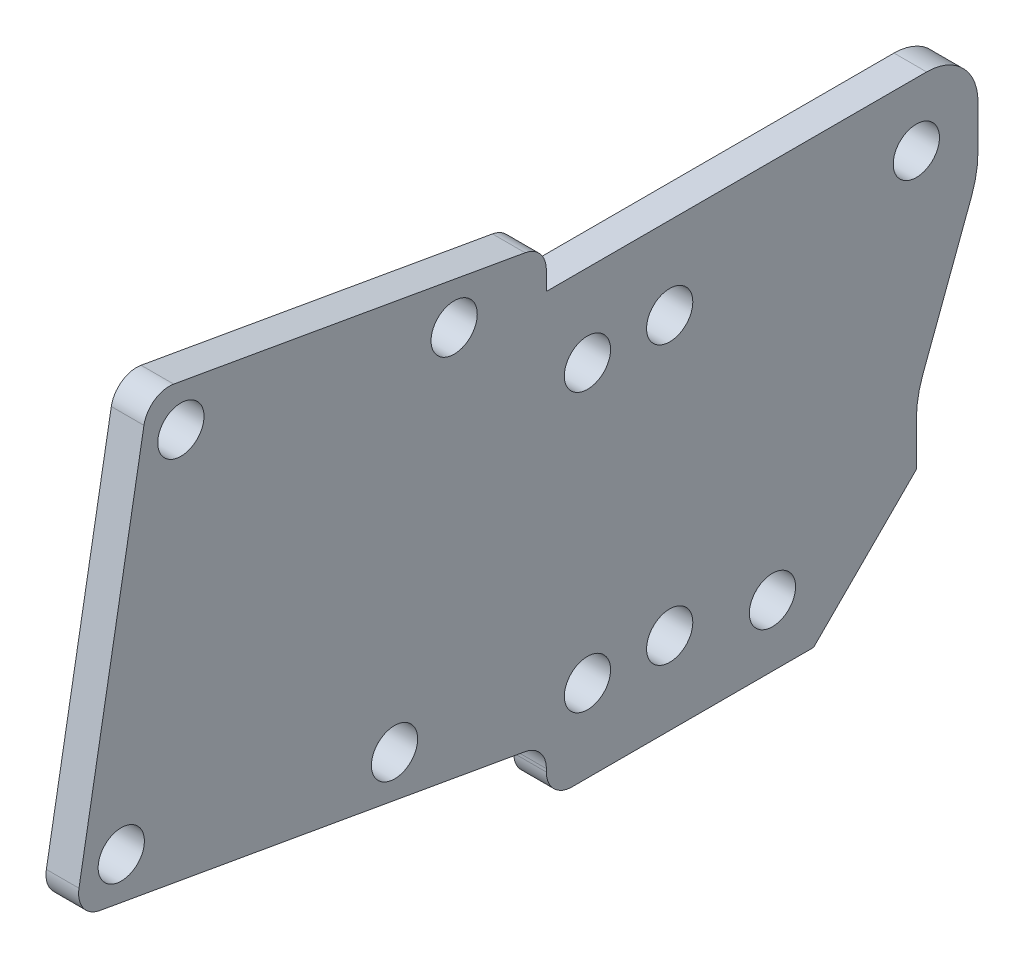
ISO-10303-21;
HEADER;
FILE_DESCRIPTION(('STEP AP214'),'2;1');
FILE_NAME('part.step','',(''),(''),'','','');
FILE_SCHEMA(('AUTOMOTIVE_DESIGN { 1 0 10303 214 1 1 1 1 }'));
ENDSEC;
DATA;
#1=APPLICATION_CONTEXT('core data for automotive mechanical design processes');
#2=APPLICATION_PROTOCOL_DEFINITION('international standard','automotive_design',2000,#1);
#3=PRODUCT_CONTEXT('',#1,'mechanical');
#4=PRODUCT('Part','Part','',(#3));
#5=PRODUCT_RELATED_PRODUCT_CATEGORY('part','',(#4));
#6=PRODUCT_DEFINITION_FORMATION('','',#4);
#7=PRODUCT_DEFINITION_CONTEXT('part definition',#1,'design');
#8=PRODUCT_DEFINITION('design','',#6,#7);
#9=PRODUCT_DEFINITION_SHAPE('','',#8);
#10=(LENGTH_UNIT() NAMED_UNIT(*) SI_UNIT(.MILLI.,.METRE.));
#11=(NAMED_UNIT(*) PLANE_ANGLE_UNIT() SI_UNIT($,.RADIAN.));
#12=(NAMED_UNIT(*) SI_UNIT($,.STERADIAN.) SOLID_ANGLE_UNIT());
#13=UNCERTAINTY_MEASURE_WITH_UNIT(LENGTH_MEASURE(1.E-05),#10,'distance_accuracy_value','');
#14=(GEOMETRIC_REPRESENTATION_CONTEXT(3) GLOBAL_UNCERTAINTY_ASSIGNED_CONTEXT((#13)) GLOBAL_UNIT_ASSIGNED_CONTEXT((#10,
#11,#12)) REPRESENTATION_CONTEXT('',''));
#15=CARTESIAN_POINT('',(0.,0.,0.));
#16=DIRECTION('',(0.,0.,1.));
#17=DIRECTION('',(1.,0.,0.));
#18=AXIS2_PLACEMENT_3D('',#15,#16,#17);
#19=CARTESIAN_POINT('',(-17.375,204.756416597147,-36.1040807192578));
#20=DIRECTION('',(0.,0.98480775301221,-0.173648177666922));
#21=DIRECTION('',(0.,0.173648177666922,0.98480775301221));
#22=AXIS2_PLACEMENT_3D('',#19,#20,#21);
#23=PLANE('',#22);
#24=DIRECTION('',(0.,0.173648177666922,0.98480775301221));
#25=VECTOR('',#24,1.);
#26=CARTESIAN_POINT('',(-14.2,204.756416597147,-36.1040807192578));
#27=LINE('',#26,#25);
#28=CARTESIAN_POINT('',(-14.2,221.819571515731,60.6658795558327));
#29=VERTEX_POINT('',#28);
#30=CARTESIAN_POINT('',(-14.2,227.84859479087,94.8581696461836));
#31=VERTEX_POINT('',#30);
#32=EDGE_CURVE('E236',#29,#31,#27,.T.);
#33=ORIENTED_EDGE('',*,*,#32,.F.);
#34=DIRECTION('',(1.,0.,0.));
#35=VECTOR('',#34,1.);
#36=CARTESIAN_POINT('',(-17.375,221.819571515731,60.6658795558327));
#37=LINE('',#36,#35);
#38=CARTESIAN_POINT('',(-17.375,221.819571515731,60.6658795558327));
#39=VERTEX_POINT('',#38);
#40=EDGE_CURVE('E11',#39,#29,#37,.T.);
#41=ORIENTED_EDGE('',*,*,#40,.F.);
#42=DIRECTION('',(0.,0.173648177666922,0.98480775301221));
#43=VECTOR('',#42,1.);
#44=CARTESIAN_POINT('',(-17.375,204.756416597147,-36.1040807192578));
#45=LINE('',#44,#43);
#46=CARTESIAN_POINT('',(-17.375,227.84859479087,94.8581696461836));
#47=VERTEX_POINT('',#46);
#48=EDGE_CURVE('E326',#39,#47,#45,.T.);
#49=ORIENTED_EDGE('',*,*,#48,.T.);
#50=DIRECTION('',(1.,0.,0.));
#51=VECTOR('',#50,1.);
#52=CARTESIAN_POINT('',(-17.375,227.84859479087,94.8581696461836));
#53=LINE('',#52,#51);
#54=EDGE_CURVE('E45',#47,#31,#53,.T.);
#55=ORIENTED_EDGE('',*,*,#54,.T.);
#56=EDGE_LOOP('',(#33,#41,#49,#55));
#57=FACE_BOUND('',#56,.T.);
#58=ADVANCED_FACE('F41',(#57),#23,.T.);
#59=CARTESIAN_POINT('',(-17.375,219.357552133201,61.1));
#60=DIRECTION('',(1.,0.,0.));
#61=DIRECTION('',(0.,0.,-1.));
#62=AXIS2_PLACEMENT_3D('',#59,#60,#61);
#63=CYLINDRICAL_SURFACE('',#62,2.50000000000001);
#64=CARTESIAN_POINT('',(-14.2,219.357552133201,61.1));
#65=DIRECTION('',(1.,0.,0.));
#66=DIRECTION('',(0.,0.,-1.));
#67=AXIS2_PLACEMENT_3D('',#64,#65,#66);
#68=CIRCLE('',#67,2.50000000000001);
#69=CARTESIAN_POINT('',(-14.2,219.357552133201,58.6));
#70=VERTEX_POINT('',#69);
#71=EDGE_CURVE('E287',#70,#29,#68,.T.);
#72=ORIENTED_EDGE('',*,*,#71,.F.);
#73=DIRECTION('',(1.,0.,0.));
#74=VECTOR('',#73,1.);
#75=CARTESIAN_POINT('',(-17.375,219.357552133201,58.6));
#76=LINE('',#75,#74);
#77=CARTESIAN_POINT('',(-17.375,219.357552133201,58.6));
#78=VERTEX_POINT('',#77);
#79=EDGE_CURVE('E51',#78,#70,#76,.T.);
#80=ORIENTED_EDGE('',*,*,#79,.F.);
#81=CARTESIAN_POINT('',(-17.375,219.357552133201,61.1));
#82=DIRECTION('',(1.,0.,0.));
#83=DIRECTION('',(0.,0.,-1.));
#84=AXIS2_PLACEMENT_3D('',#81,#82,#83);
#85=CIRCLE('',#84,2.50000000000001);
#86=EDGE_CURVE('E196',#78,#39,#85,.T.);
#87=ORIENTED_EDGE('',*,*,#86,.T.);
#88=ORIENTED_EDGE('',*,*,#40,.T.);
#89=EDGE_LOOP('',(#72,#80,#87,#88));
#90=FACE_BOUND('',#89,.T.);
#91=ADVANCED_FACE('F331',(#90),#63,.T.);
#92=CARTESIAN_POINT('',(-17.375,-2.21886829521607E-13,58.5999999999992));
#93=DIRECTION('',(0.,0.,-1.));
#94=DIRECTION('',(0.,1.,0.));
#95=AXIS2_PLACEMENT_3D('',#92,#93,#94);
#96=PLANE('',#95);
#97=DIRECTION('',(0.,1.,0.));
#98=VECTOR('',#97,1.);
#99=CARTESIAN_POINT('',(-14.2,-2.21886829521607E-13,58.5999999999992));
#100=LINE('',#99,#98);
#101=CARTESIAN_POINT('',(-14.2,217.525,58.6));
#102=VERTEX_POINT('',#101);
#103=EDGE_CURVE('E182',#102,#70,#100,.T.);
#104=ORIENTED_EDGE('',*,*,#103,.F.);
#105=DIRECTION('',(1.,0.,0.));
#106=VECTOR('',#105,1.);
#107=CARTESIAN_POINT('',(-17.375,217.525,58.6));
#108=LINE('',#107,#106);
#109=CARTESIAN_POINT('',(-17.375,217.525,58.6));
#110=VERTEX_POINT('',#109);
#111=EDGE_CURVE('E177',#110,#102,#108,.T.);
#112=ORIENTED_EDGE('',*,*,#111,.F.);
#113=DIRECTION('',(0.,1.,0.));
#114=VECTOR('',#113,1.);
#115=CARTESIAN_POINT('',(-17.375,-2.21886829521607E-13,58.5999999999992));
#116=LINE('',#115,#114);
#117=EDGE_CURVE('E180',#110,#78,#116,.T.);
#118=ORIENTED_EDGE('',*,*,#117,.T.);
#119=ORIENTED_EDGE('',*,*,#79,.T.);
#120=EDGE_LOOP('',(#104,#112,#118,#119));
#121=FACE_BOUND('',#120,.T.);
#122=ADVANCED_FACE('F179',(#121),#96,.T.);
#123=CARTESIAN_POINT('',(-17.375,217.525,-1.63176529345667E-13));
#124=DIRECTION('',(0.,1.,0.));
#125=DIRECTION('',(0.,0.,1.));
#126=AXIS2_PLACEMENT_3D('',#123,#124,#125);
#127=PLANE('',#126);
#128=DIRECTION('',(0.,0.,1.));
#129=VECTOR('',#128,1.);
#130=CARTESIAN_POINT('',(-14.2,217.525,-1.63176529345667E-13));
#131=LINE('',#130,#129);
#132=CARTESIAN_POINT('',(-14.2,217.525,21.6));
#133=VERTEX_POINT('',#132);
#134=EDGE_CURVE('E284',#133,#102,#131,.T.);
#135=ORIENTED_EDGE('',*,*,#134,.F.);
#136=DIRECTION('',(1.,0.,0.));
#137=VECTOR('',#136,1.);
#138=CARTESIAN_POINT('',(-17.375,217.525,21.6));
#139=LINE('',#138,#137);
#140=CARTESIAN_POINT('',(-17.375,217.525,21.6));
#141=VERTEX_POINT('',#140);
#142=EDGE_CURVE('E187',#141,#133,#139,.T.);
#143=ORIENTED_EDGE('',*,*,#142,.F.);
#144=DIRECTION('',(0.,0.,1.));
#145=VECTOR('',#144,1.);
#146=CARTESIAN_POINT('',(-17.375,217.525,-1.63176529345667E-13));
#147=LINE('',#146,#145);
#148=EDGE_CURVE('E194',#141,#110,#147,.T.);
#149=ORIENTED_EDGE('',*,*,#148,.T.);
#150=ORIENTED_EDGE('',*,*,#111,.T.);
#151=EDGE_LOOP('',(#135,#143,#149,#150));
#152=FACE_BOUND('',#151,.T.);
#153=ADVANCED_FACE('F198',(#152),#127,.T.);
#154=CARTESIAN_POINT('',(-17.375,212.525,21.6));
#155=DIRECTION('',(1.,0.,0.));
#156=DIRECTION('',(0.,0.,-1.));
#157=AXIS2_PLACEMENT_3D('',#154,#155,#156);
#158=CYLINDRICAL_SURFACE('',#157,5.);
#159=CARTESIAN_POINT('',(-14.2,212.525,21.6));
#160=DIRECTION('',(1.,0.,0.));
#161=DIRECTION('',(0.,0.,-1.));
#162=AXIS2_PLACEMENT_3D('',#159,#160,#161);
#163=CIRCLE('',#162,5.);
#164=CARTESIAN_POINT('',(-14.2,212.525,16.6));
#165=VERTEX_POINT('',#164);
#166=EDGE_CURVE('E281',#165,#133,#163,.T.);
#167=ORIENTED_EDGE('',*,*,#166,.F.);
#168=DIRECTION('',(1.,0.,0.));
#169=VECTOR('',#168,1.);
#170=CARTESIAN_POINT('',(-17.375,212.525,16.6));
#171=LINE('',#170,#169);
#172=CARTESIAN_POINT('',(-17.375,212.525,16.6));
#173=VERTEX_POINT('',#172);
#174=EDGE_CURVE('E299',#173,#165,#171,.T.);
#175=ORIENTED_EDGE('',*,*,#174,.F.);
#176=CARTESIAN_POINT('',(-17.375,212.525,21.6));
#177=DIRECTION('',(1.,0.,0.));
#178=DIRECTION('',(0.,0.,-1.));
#179=AXIS2_PLACEMENT_3D('',#176,#177,#178);
#180=CIRCLE('',#179,5.);
#181=EDGE_CURVE('E199',#173,#141,#180,.T.);
#182=ORIENTED_EDGE('',*,*,#181,.T.);
#183=ORIENTED_EDGE('',*,*,#142,.T.);
#184=EDGE_LOOP('',(#167,#175,#182,#183));
#185=FACE_BOUND('',#184,.T.);
#186=ADVANCED_FACE('F346',(#185),#158,.T.);
#187=CARTESIAN_POINT('',(-17.375,0.,16.6));
#188=DIRECTION('',(0.,0.,-1.));
#189=DIRECTION('',(-1.,0.,0.));
#190=AXIS2_PLACEMENT_3D('',#187,#188,#189);
#191=PLANE('',#190);
#192=DIRECTION('',(0.,1.,0.));
#193=VECTOR('',#192,1.);
#194=CARTESIAN_POINT('',(-14.2,0.,16.6));
#195=LINE('',#194,#193);
#196=CARTESIAN_POINT('',(-14.2,208.338345817725,16.6));
#197=VERTEX_POINT('',#196);
#198=EDGE_CURVE('E278',#197,#165,#195,.T.);
#199=ORIENTED_EDGE('',*,*,#198,.F.);
#200=DIRECTION('',(1.,0.,0.));
#201=VECTOR('',#200,1.);
#202=CARTESIAN_POINT('',(-17.375,208.338345817725,16.6));
#203=LINE('',#202,#201);
#204=CARTESIAN_POINT('',(-17.375,208.338345817725,16.6));
#205=VERTEX_POINT('',#204);
#206=EDGE_CURVE('E301',#205,#197,#203,.T.);
#207=ORIENTED_EDGE('',*,*,#206,.F.);
#208=DIRECTION('',(0.,1.,0.));
#209=VECTOR('',#208,1.);
#210=CARTESIAN_POINT('',(-17.375,0.,16.6));
#211=LINE('',#210,#209);
#212=EDGE_CURVE('E201',#205,#173,#211,.T.);
#213=ORIENTED_EDGE('',*,*,#212,.T.);
#214=ORIENTED_EDGE('',*,*,#174,.T.);
#215=EDGE_LOOP('',(#199,#207,#213,#214));
#216=FACE_BOUND('',#215,.T.);
#217=ADVANCED_FACE('F349',(#216),#191,.T.);
#218=CARTESIAN_POINT('',(-17.375,208.338345817725,26.6));
#219=DIRECTION('',(1.,0.,0.));
#220=DIRECTION('',(0.,0.,-1.));
#221=AXIS2_PLACEMENT_3D('',#218,#219,#220);
#222=CYLINDRICAL_SURFACE('',#221,10.);
#223=CARTESIAN_POINT('',(-14.2,208.338345817725,26.6));
#224=DIRECTION('',(1.,0.,0.));
#225=DIRECTION('',(0.,0.,-1.));
#226=AXIS2_PLACEMENT_3D('',#223,#224,#225);
#227=CIRCLE('',#226,10.);
#228=CARTESIAN_POINT('',(-14.2,204.827111401841,17.2367082243095));
#229=VERTEX_POINT('',#228);
#230=EDGE_CURVE('E275',#229,#197,#227,.T.);
#231=ORIENTED_EDGE('',*,*,#230,.F.);
#232=DIRECTION('',(1.,0.,0.));
#233=VECTOR('',#232,1.);
#234=CARTESIAN_POINT('',(-17.375,204.827111401841,17.2367082243095));
#235=LINE('',#234,#233);
#236=CARTESIAN_POINT('',(-17.375,204.827111401841,17.2367082243095));
#237=VERTEX_POINT('',#236);
#238=EDGE_CURVE('E303',#237,#229,#235,.T.);
#239=ORIENTED_EDGE('',*,*,#238,.F.);
#240=CARTESIAN_POINT('',(-17.375,208.338345817725,26.6));
#241=DIRECTION('',(1.,0.,0.));
#242=DIRECTION('',(0.,0.,-1.));
#243=AXIS2_PLACEMENT_3D('',#240,#241,#242);
#244=CIRCLE('',#243,10.);
#245=EDGE_CURVE('E727',#237,#205,#244,.T.);
#246=ORIENTED_EDGE('',*,*,#245,.T.);
#247=ORIENTED_EDGE('',*,*,#206,.T.);
#248=EDGE_LOOP('',(#231,#239,#246,#247));
#249=FACE_BOUND('',#248,.T.);
#250=ADVANCED_FACE('F353',(#249),#222,.T.);
#251=CARTESIAN_POINT('',(-17.375,30.9195205479452,82.4520547945205));
#252=DIRECTION('',(0.,-0.351123441588391,-0.936329177569045));
#253=DIRECTION('',(0.,0.936329177569045,-0.351123441588391));
#254=AXIS2_PLACEMENT_3D('',#251,#252,#253);
#255=PLANE('',#254);
#256=DIRECTION('',(0.,0.936329177569045,-0.351123441588391));
#257=VECTOR('',#256,1.);
#258=CARTESIAN_POINT('',(-14.2,30.9195205479452,82.4520547945205));
#259=LINE('',#258,#257);
#260=CARTESIAN_POINT('',(-14.2,192.222888598159,21.9632917756904));
#261=VERTEX_POINT('',#260);
#262=EDGE_CURVE('E272',#261,#229,#259,.T.);
#263=ORIENTED_EDGE('',*,*,#262,.F.);
#264=DIRECTION('',(1.,0.,0.));
#265=VECTOR('',#264,1.);
#266=CARTESIAN_POINT('',(-17.375,192.222888598159,21.9632917756904));
#267=LINE('',#266,#265);
#268=CARTESIAN_POINT('',(-17.375,192.222888598159,21.9632917756904));
#269=VERTEX_POINT('',#268);
#270=EDGE_CURVE('E305',#269,#261,#267,.T.);
#271=ORIENTED_EDGE('',*,*,#270,.F.);
#272=DIRECTION('',(0.,0.936329177569045,-0.351123441588391));
#273=VECTOR('',#272,1.);
#274=CARTESIAN_POINT('',(-17.375,30.9195205479452,82.4520547945205));
#275=LINE('',#274,#273);
#276=EDGE_CURVE('E724',#269,#237,#275,.T.);
#277=ORIENTED_EDGE('',*,*,#276,.T.);
#278=ORIENTED_EDGE('',*,*,#238,.T.);
#279=EDGE_LOOP('',(#263,#271,#277,#278));
#280=FACE_BOUND('',#279,.T.);
#281=ADVANCED_FACE('F357',(#280),#255,.T.);
#282=CARTESIAN_POINT('',(-17.375,188.711654182275,12.6));
#283=DIRECTION('',(1.,0.,0.));
#284=DIRECTION('',(0.,0.,-1.));
#285=AXIS2_PLACEMENT_3D('',#282,#283,#284);
#286=CYLINDRICAL_SURFACE('',#285,10.);
#287=CARTESIAN_POINT('',(-14.2,188.711654182275,12.6));
#288=DIRECTION('',(1.,0.,0.));
#289=DIRECTION('',(0.,0.,-1.));
#290=AXIS2_PLACEMENT_3D('',#287,#288,#289);
#291=CIRCLE('',#290,10.);
#292=CARTESIAN_POINT('',(-14.2,188.711654182275,22.6));
#293=VERTEX_POINT('',#292);
#294=EDGE_CURVE('E269',#293,#261,#291,.F.);
#295=ORIENTED_EDGE('',*,*,#294,.F.);
#296=DIRECTION('',(1.,0.,0.));
#297=VECTOR('',#296,1.);
#298=CARTESIAN_POINT('',(-17.375,188.711654182275,22.6));
#299=LINE('',#298,#297);
#300=CARTESIAN_POINT('',(-17.375,188.711654182275,22.6));
#301=VERTEX_POINT('',#300);
#302=EDGE_CURVE('E307',#301,#293,#299,.T.);
#303=ORIENTED_EDGE('',*,*,#302,.F.);
#304=CARTESIAN_POINT('',(-17.375,188.711654182275,12.6));
#305=DIRECTION('',(1.,0.,0.));
#306=DIRECTION('',(0.,0.,-1.));
#307=AXIS2_PLACEMENT_3D('',#304,#305,#306);
#308=CIRCLE('',#307,10.);
#309=EDGE_CURVE('E721',#301,#269,#308,.F.);
#310=ORIENTED_EDGE('',*,*,#309,.T.);
#311=ORIENTED_EDGE('',*,*,#270,.T.);
#312=EDGE_LOOP('',(#295,#303,#310,#311));
#313=FACE_BOUND('',#312,.T.);
#314=ADVANCED_FACE('F361',(#313),#286,.F.);
#315=CARTESIAN_POINT('',(-17.375,0.,22.6));
#316=DIRECTION('',(0.,0.,-1.));
#317=DIRECTION('',(-1.,0.,0.));
#318=AXIS2_PLACEMENT_3D('',#315,#316,#317);
#319=PLANE('',#318);
#320=DIRECTION('',(0.,1.,0.));
#321=VECTOR('',#320,1.);
#322=CARTESIAN_POINT('',(-14.2,0.,22.6));
#323=LINE('',#322,#321);
#324=CARTESIAN_POINT('',(-14.2,184.525,22.6));
#325=VERTEX_POINT('',#324);
#326=EDGE_CURVE('E266',#325,#293,#323,.T.);
#327=ORIENTED_EDGE('',*,*,#326,.F.);
#328=DIRECTION('',(1.,0.,0.));
#329=VECTOR('',#328,1.);
#330=CARTESIAN_POINT('',(-17.375,184.525,22.6));
#331=LINE('',#330,#329);
#332=CARTESIAN_POINT('',(-17.375,184.525,22.6));
#333=VERTEX_POINT('',#332);
#334=EDGE_CURVE('E309',#333,#325,#331,.T.);
#335=ORIENTED_EDGE('',*,*,#334,.F.);
#336=DIRECTION('',(0.,1.,0.));
#337=VECTOR('',#336,1.);
#338=CARTESIAN_POINT('',(-17.375,0.,22.6));
#339=LINE('',#338,#337);
#340=EDGE_CURVE('E718',#333,#301,#339,.T.);
#341=ORIENTED_EDGE('',*,*,#340,.T.);
#342=ORIENTED_EDGE('',*,*,#302,.T.);
#343=EDGE_LOOP('',(#327,#335,#341,#342));
#344=FACE_BOUND('',#343,.T.);
#345=ADVANCED_FACE('F365',(#344),#319,.T.);
#346=CARTESIAN_POINT('',(-17.375,103.5625,103.5625));
#347=DIRECTION('',(0.,0.707106781186547,0.707106781186548));
#348=DIRECTION('',(0.,-0.707106781186548,0.707106781186547));
#349=AXIS2_PLACEMENT_3D('',#346,#347,#348);
#350=PLANE('',#349);
#351=DIRECTION('',(0.,-0.707106781186548,0.707106781186547));
#352=VECTOR('',#351,1.);
#353=CARTESIAN_POINT('',(-14.2,103.5625,103.5625));
#354=LINE('',#353,#352);
#355=CARTESIAN_POINT('',(-14.2,174.525,32.6));
#356=VERTEX_POINT('',#355);
#357=EDGE_CURVE('E263',#325,#356,#354,.T.);
#358=ORIENTED_EDGE('',*,*,#357,.T.);
#359=DIRECTION('',(1.,0.,0.));
#360=VECTOR('',#359,1.);
#361=CARTESIAN_POINT('',(-17.375,174.525,32.6));
#362=LINE('',#361,#360);
#363=CARTESIAN_POINT('',(-17.375,174.525,32.6));
#364=VERTEX_POINT('',#363);
#365=EDGE_CURVE('E311',#364,#356,#362,.T.);
#366=ORIENTED_EDGE('',*,*,#365,.F.);
#367=DIRECTION('',(0.,-0.707106781186548,0.707106781186547));
#368=VECTOR('',#367,1.);
#369=CARTESIAN_POINT('',(-17.375,103.5625,103.5625));
#370=LINE('',#369,#368);
#371=EDGE_CURVE('E716',#333,#364,#370,.T.);
#372=ORIENTED_EDGE('',*,*,#371,.F.);
#373=ORIENTED_EDGE('',*,*,#334,.T.);
#374=EDGE_LOOP('',(#358,#366,#372,#373));
#375=FACE_BOUND('',#374,.T.);
#376=ADVANCED_FACE('F369',(#375),#350,.F.);
#377=CARTESIAN_POINT('',(-17.375,174.525,0.));
#378=DIRECTION('',(0.,-1.,0.));
#379=DIRECTION('',(0.,0.,-1.));
#380=AXIS2_PLACEMENT_3D('',#377,#378,#379);
#381=PLANE('',#380);
#382=DIRECTION('',(0.,0.,-1.));
#383=VECTOR('',#382,1.);
#384=CARTESIAN_POINT('',(-14.2,174.525,0.));
#385=LINE('',#384,#383);
#386=CARTESIAN_POINT('',(-14.2,174.525,56.1));
#387=VERTEX_POINT('',#386);
#388=EDGE_CURVE('E260',#387,#356,#385,.T.);
#389=ORIENTED_EDGE('',*,*,#388,.F.);
#390=DIRECTION('',(1.,0.,0.));
#391=VECTOR('',#390,1.);
#392=CARTESIAN_POINT('',(-17.375,174.525,56.1));
#393=LINE('',#392,#391);
#394=CARTESIAN_POINT('',(-17.375,174.525,56.1));
#395=VERTEX_POINT('',#394);
#396=EDGE_CURVE('E313',#395,#387,#393,.T.);
#397=ORIENTED_EDGE('',*,*,#396,.F.);
#398=DIRECTION('',(0.,0.,-1.));
#399=VECTOR('',#398,1.);
#400=CARTESIAN_POINT('',(-17.375,174.525,0.));
#401=LINE('',#400,#399);
#402=EDGE_CURVE('E713',#395,#364,#401,.T.);
#403=ORIENTED_EDGE('',*,*,#402,.T.);
#404=ORIENTED_EDGE('',*,*,#365,.T.);
#405=EDGE_LOOP('',(#389,#397,#403,#404));
#406=FACE_BOUND('',#405,.T.);
#407=ADVANCED_FACE('F373',(#406),#381,.T.);
#408=CARTESIAN_POINT('',(-17.375,177.025,56.1));
#409=DIRECTION('',(1.,0.,0.));
#410=DIRECTION('',(0.,0.,-1.));
#411=AXIS2_PLACEMENT_3D('',#408,#409,#410);
#412=CYLINDRICAL_SURFACE('',#411,2.5);
#413=CARTESIAN_POINT('',(-14.2,177.025,56.1));
#414=DIRECTION('',(1.,0.,0.));
#415=DIRECTION('',(0.,0.,-1.));
#416=AXIS2_PLACEMENT_3D('',#413,#414,#415);
#417=CIRCLE('',#416,2.5);
#418=CARTESIAN_POINT('',(-14.2,177.025,58.6));
#419=VERTEX_POINT('',#418);
#420=EDGE_CURVE('E257',#419,#387,#417,.T.);
#421=ORIENTED_EDGE('',*,*,#420,.F.);
#422=DIRECTION('',(1.,0.,0.));
#423=VECTOR('',#422,1.);
#424=CARTESIAN_POINT('',(-17.375,177.025,58.6));
#425=LINE('',#424,#423);
#426=CARTESIAN_POINT('',(-17.375,177.025,58.6));
#427=VERTEX_POINT('',#426);
#428=EDGE_CURVE('E315',#427,#419,#425,.T.);
#429=ORIENTED_EDGE('',*,*,#428,.F.);
#430=CARTESIAN_POINT('',(-17.375,177.025,56.1));
#431=DIRECTION('',(1.,0.,0.));
#432=DIRECTION('',(0.,0.,-1.));
#433=AXIS2_PLACEMENT_3D('',#430,#431,#432);
#434=CIRCLE('',#433,2.5);
#435=EDGE_CURVE('E710',#427,#395,#434,.T.);
#436=ORIENTED_EDGE('',*,*,#435,.T.);
#437=ORIENTED_EDGE('',*,*,#396,.T.);
#438=EDGE_LOOP('',(#421,#429,#436,#437));
#439=FACE_BOUND('',#438,.T.);
#440=ADVANCED_FACE('F377',(#439),#412,.T.);
#441=CARTESIAN_POINT('',(-17.375,0.,58.6));
#442=DIRECTION('',(0.,0.,1.));
#443=DIRECTION('',(1.,0.,0.));
#444=AXIS2_PLACEMENT_3D('',#441,#442,#443);
#445=PLANE('',#444);
#446=DIRECTION('',(0.,-1.,0.));
#447=VECTOR('',#446,1.);
#448=CARTESIAN_POINT('',(-14.2,0.,58.6));
#449=LINE('',#448,#447);
#450=CARTESIAN_POINT('',(-14.2,177.318890401131,58.6));
#451=VERTEX_POINT('',#450);
#452=EDGE_CURVE('E254',#451,#419,#449,.T.);
#453=ORIENTED_EDGE('',*,*,#452,.F.);
#454=DIRECTION('',(1.,0.,0.));
#455=VECTOR('',#454,1.);
#456=CARTESIAN_POINT('',(-17.375,177.318890401131,58.6));
#457=LINE('',#456,#455);
#458=CARTESIAN_POINT('',(-17.375,177.318890401131,58.6));
#459=VERTEX_POINT('',#458);
#460=EDGE_CURVE('E317',#459,#451,#457,.T.);
#461=ORIENTED_EDGE('',*,*,#460,.F.);
#462=DIRECTION('',(0.,-1.,0.));
#463=VECTOR('',#462,1.);
#464=CARTESIAN_POINT('',(-17.375,0.,58.6));
#465=LINE('',#464,#463);
#466=EDGE_CURVE('E707',#459,#427,#465,.T.);
#467=ORIENTED_EDGE('',*,*,#466,.T.);
#468=ORIENTED_EDGE('',*,*,#428,.T.);
#469=EDGE_LOOP('',(#453,#461,#467,#468));
#470=FACE_BOUND('',#469,.T.);
#471=ADVANCED_FACE('F381',(#470),#445,.T.);
#472=CARTESIAN_POINT('',(-17.375,177.318890401131,61.1));
#473=DIRECTION('',(1.,0.,0.));
#474=DIRECTION('',(0.,0.,-1.));
#475=AXIS2_PLACEMENT_3D('',#472,#473,#474);
#476=CYLINDRICAL_SURFACE('',#475,2.5);
#477=CARTESIAN_POINT('',(-14.2,177.318890401131,61.1));
#478=DIRECTION('',(1.,0.,0.));
#479=DIRECTION('',(0.,0.,-1.));
#480=AXIS2_PLACEMENT_3D('',#477,#478,#479);
#481=CIRCLE('',#480,2.5);
#482=CARTESIAN_POINT('',(-14.2,179.780909783661,60.6658795558327));
#483=VERTEX_POINT('',#482);
#484=EDGE_CURVE('E251',#483,#451,#481,.F.);
#485=ORIENTED_EDGE('',*,*,#484,.F.);
#486=DIRECTION('',(1.,0.,0.));
#487=VECTOR('',#486,1.);
#488=CARTESIAN_POINT('',(-17.375,179.780909783661,60.6658795558327));
#489=LINE('',#488,#487);
#490=CARTESIAN_POINT('',(-17.375,179.780909783661,60.6658795558327));
#491=VERTEX_POINT('',#490);
#492=EDGE_CURVE('E319',#491,#483,#489,.T.);
#493=ORIENTED_EDGE('',*,*,#492,.F.);
#494=CARTESIAN_POINT('',(-17.375,177.318890401131,61.1));
#495=DIRECTION('',(1.,0.,0.));
#496=DIRECTION('',(0.,0.,-1.));
#497=AXIS2_PLACEMENT_3D('',#494,#495,#496);
#498=CIRCLE('',#497,2.5);
#499=EDGE_CURVE('E704',#491,#459,#498,.F.);
#500=ORIENTED_EDGE('',*,*,#499,.T.);
#501=ORIENTED_EDGE('',*,*,#460,.T.);
#502=EDGE_LOOP('',(#485,#493,#500,#501));
#503=FACE_BOUND('',#502,.T.);
#504=ADVANCED_FACE('F385',(#503),#476,.F.);
#505=CARTESIAN_POINT('',(-17.375,163.985375622442,-28.9150461638475));
#506=DIRECTION('',(0.,-0.984807753012209,0.173648177666924));
#507=DIRECTION('',(0.,-0.173648177666924,-0.984807753012209));
#508=AXIS2_PLACEMENT_3D('',#505,#506,#507);
#509=PLANE('',#508);
#510=DIRECTION('',(0.,-0.173648177666924,-0.984807753012209));
#511=VECTOR('',#510,1.);
#512=CARTESIAN_POINT('',(-14.2,163.985375622442,-28.9150461638475));
#513=LINE('',#512,#511);
#514=CARTESIAN_POINT('',(-14.2,187.077553816165,102.047204201594));
#515=VERTEX_POINT('',#514);
#516=EDGE_CURVE('E248',#515,#483,#513,.T.);
#517=ORIENTED_EDGE('',*,*,#516,.F.);
#518=DIRECTION('',(1.,0.,0.));
#519=VECTOR('',#518,1.);
#520=CARTESIAN_POINT('',(-17.375,187.077553816165,102.047204201594));
#521=LINE('',#520,#519);
#522=CARTESIAN_POINT('',(-17.375,187.077553816165,102.047204201594));
#523=VERTEX_POINT('',#522);
#524=EDGE_CURVE('E321',#523,#515,#521,.T.);
#525=ORIENTED_EDGE('',*,*,#524,.F.);
#526=DIRECTION('',(0.,-0.173648177666924,-0.984807753012209));
#527=VECTOR('',#526,1.);
#528=CARTESIAN_POINT('',(-17.375,163.985375622442,-28.9150461638475));
#529=LINE('',#528,#527);
#530=EDGE_CURVE('E701',#523,#491,#529,.T.);
#531=ORIENTED_EDGE('',*,*,#530,.T.);
#532=ORIENTED_EDGE('',*,*,#492,.T.);
#533=EDGE_LOOP('',(#517,#525,#531,#532));
#534=FACE_BOUND('',#533,.T.);
#535=ADVANCED_FACE('F389',(#534),#509,.T.);
#536=CARTESIAN_POINT('',(-17.375,189.539573198696,101.613083757427));
#537=DIRECTION('',(1.,0.,0.));
#538=DIRECTION('',(0.,0.,-1.));
#539=AXIS2_PLACEMENT_3D('',#536,#537,#538);
#540=CYLINDRICAL_SURFACE('',#539,2.49999999999998);
#541=CARTESIAN_POINT('',(-14.2,189.539573198696,101.613083757427));
#542=DIRECTION('',(1.,0.,0.));
#543=DIRECTION('',(0.,0.,-1.));
#544=AXIS2_PLACEMENT_3D('',#541,#542,#543);
#545=CIRCLE('',#544,2.49999999999998);
#546=CARTESIAN_POINT('',(-14.2,189.973693642863,104.075103139957));
#547=VERTEX_POINT('',#546);
#548=EDGE_CURVE('E245',#547,#515,#545,.T.);
#549=ORIENTED_EDGE('',*,*,#548,.F.);
#550=DIRECTION('',(1.,0.,0.));
#551=VECTOR('',#550,1.);
#552=CARTESIAN_POINT('',(-17.375,189.973693642863,104.075103139957));
#553=LINE('',#552,#551);
#554=CARTESIAN_POINT('',(-17.375,189.973693642863,104.075103139957));
#555=VERTEX_POINT('',#554);
#556=EDGE_CURVE('E323',#555,#547,#553,.T.);
#557=ORIENTED_EDGE('',*,*,#556,.F.);
#558=CARTESIAN_POINT('',(-17.375,189.539573198696,101.613083757427));
#559=DIRECTION('',(1.,0.,0.));
#560=DIRECTION('',(0.,0.,-1.));
#561=AXIS2_PLACEMENT_3D('',#558,#559,#560);
#562=CIRCLE('',#561,2.49999999999998);
#563=EDGE_CURVE('E698',#555,#523,#562,.T.);
#564=ORIENTED_EDGE('',*,*,#563,.T.);
#565=ORIENTED_EDGE('',*,*,#524,.T.);
#566=EDGE_LOOP('',(#549,#557,#564,#565));
#567=FACE_BOUND('',#566,.T.);
#568=ADVANCED_FACE('F393',(#567),#540,.T.);
#569=CARTESIAN_POINT('',(-17.375,23.5262986378906,133.424269747972));
#570=DIRECTION('',(0.,0.173648177666923,0.984807753012209));
#571=DIRECTION('',(0.,-0.98480775301221,0.173648177666923));
#572=AXIS2_PLACEMENT_3D('',#569,#570,#571);
#573=PLANE('',#572);
#574=DIRECTION('',(0.,-0.98480775301221,0.173648177666923));
#575=VECTOR('',#574,1.);
#576=CARTESIAN_POINT('',(-14.2,23.5262986378906,133.424269747972));
#577=LINE('',#576,#575);
#578=CARTESIAN_POINT('',(-14.2,225.820695852507,97.7543094728815));
#579=VERTEX_POINT('',#578);
#580=EDGE_CURVE('E242',#579,#547,#577,.T.);
#581=ORIENTED_EDGE('',*,*,#580,.F.);
#582=DIRECTION('',(1.,0.,0.));
#583=VECTOR('',#582,1.);
#584=CARTESIAN_POINT('',(-17.375,225.820695852507,97.7543094728815));
#585=LINE('',#584,#583);
#586=CARTESIAN_POINT('',(-17.375,225.820695852507,97.7543094728815));
#587=VERTEX_POINT('',#586);
#588=EDGE_CURVE('E324',#587,#579,#585,.T.);
#589=ORIENTED_EDGE('',*,*,#588,.F.);
#590=DIRECTION('',(0.,-0.98480775301221,0.173648177666923));
#591=VECTOR('',#590,1.);
#592=CARTESIAN_POINT('',(-17.375,23.5262986378906,133.424269747972));
#593=LINE('',#592,#591);
#594=EDGE_CURVE('E695',#587,#555,#593,.T.);
#595=ORIENTED_EDGE('',*,*,#594,.T.);
#596=ORIENTED_EDGE('',*,*,#556,.T.);
#597=EDGE_LOOP('',(#581,#589,#595,#596));
#598=FACE_BOUND('',#597,.T.);
#599=ADVANCED_FACE('F397',(#598),#573,.T.);
#600=CARTESIAN_POINT('',(-17.375,182.525,54.6));
#601=DIRECTION('',(1.,0.,0.));
#602=DIRECTION('',(0.,0.,-1.));
#603=AXIS2_PLACEMENT_3D('',#600,#601,#602);
#604=CYLINDRICAL_SURFACE('',#603,2.25);
#605=CARTESIAN_POINT('',(-17.375,182.525,54.6));
#606=DIRECTION('',(1.,0.,0.));
#607=DIRECTION('',(0.,0.,-1.));
#608=AXIS2_PLACEMENT_3D('',#605,#606,#607);
#609=CIRCLE('',#608,2.25);
#610=CARTESIAN_POINT('',(-17.375,182.525,52.35));
#611=VERTEX_POINT('',#610);
#612=EDGE_CURVE('E206',#611,#611,#609,.F.);
#613=ORIENTED_EDGE('',*,*,#612,.T.);
#614=EDGE_LOOP('',(#613));
#615=FACE_BOUND('',#614,.T.);
#616=CARTESIAN_POINT('',(-14.2,182.525,54.6));
#617=DIRECTION('',(1.,0.,0.));
#618=DIRECTION('',(0.,0.,-1.));
#619=AXIS2_PLACEMENT_3D('',#616,#617,#618);
#620=CIRCLE('',#619,2.25);
#621=CARTESIAN_POINT('',(-14.2,182.525,52.35));
#622=VERTEX_POINT('',#621);
#623=EDGE_CURVE('E290',#622,#622,#620,.F.);
#624=ORIENTED_EDGE('',*,*,#623,.F.);
#625=EDGE_LOOP('',(#624));
#626=FACE_BOUND('',#625,.T.);
#627=ADVANCED_FACE('F341',(#615,#626),#604,.F.);
#628=CARTESIAN_POINT('',(-17.375,225.38657540834,95.2922900903509));
#629=DIRECTION('',(1.,0.,0.));
#630=DIRECTION('',(0.,0.,-1.));
#631=AXIS2_PLACEMENT_3D('',#628,#629,#630);
#632=CYLINDRICAL_SURFACE('',#631,2.49999999999999);
#633=CARTESIAN_POINT('',(-14.2,225.38657540834,95.2922900903509));
#634=DIRECTION('',(1.,0.,0.));
#635=DIRECTION('',(0.,0.,-1.));
#636=AXIS2_PLACEMENT_3D('',#633,#634,#635);
#637=CIRCLE('',#636,2.49999999999999);
#638=EDGE_CURVE('E239',#31,#579,#637,.T.);
#639=ORIENTED_EDGE('',*,*,#638,.F.);
#640=ORIENTED_EDGE('',*,*,#54,.F.);
#641=CARTESIAN_POINT('',(-17.375,225.38657540834,95.2922900903509));
#642=DIRECTION('',(1.,0.,0.));
#643=DIRECTION('',(0.,0.,-1.));
#644=AXIS2_PLACEMENT_3D('',#641,#642,#643);
#645=CIRCLE('',#644,2.49999999999999);
#646=EDGE_CURVE('E689',#47,#587,#645,.T.);
#647=ORIENTED_EDGE('',*,*,#646,.T.);
#648=ORIENTED_EDGE('',*,*,#588,.T.);
#649=EDGE_LOOP('',(#639,#640,#647,#648));
#650=FACE_BOUND('',#649,.T.);
#651=ADVANCED_FACE('F327',(#650),#632,.T.);
#652=CARTESIAN_POINT('',(-17.375,218.975647542229,67.5722671611079));
#653=DIRECTION('',(1.,0.,0.));
#654=DIRECTION('',(0.,0.,-1.));
#655=AXIS2_PLACEMENT_3D('',#652,#653,#654);
#656=CYLINDRICAL_SURFACE('',#655,2.25);
#657=CARTESIAN_POINT('',(-17.375,218.975647542229,67.5722671611079));
#658=DIRECTION('',(1.,0.,0.));
#659=DIRECTION('',(0.,0.,-1.));
#660=AXIS2_PLACEMENT_3D('',#657,#658,#659);
#661=CIRCLE('',#660,2.25);
#662=CARTESIAN_POINT('',(-17.375,218.975647542229,65.3222671611079));
#663=VERTEX_POINT('',#662);
#664=EDGE_CURVE('E687',#663,#663,#661,.T.);
#665=ORIENTED_EDGE('',*,*,#664,.F.);
#666=EDGE_LOOP('',(#665));
#667=FACE_BOUND('',#666,.T.);
#668=CARTESIAN_POINT('',(-14.2,218.975647542229,67.5722671611079));
#669=DIRECTION('',(1.,0.,0.));
#670=DIRECTION('',(0.,0.,-1.));
#671=AXIS2_PLACEMENT_3D('',#668,#669,#670);
#672=CIRCLE('',#671,2.25);
#673=CARTESIAN_POINT('',(-14.2,218.975647542229,65.3222671611079));
#674=VERTEX_POINT('',#673);
#675=EDGE_CURVE('E233',#674,#674,#672,.T.);
#676=ORIENTED_EDGE('',*,*,#675,.T.);
#677=EDGE_LOOP('',(#676));
#678=FACE_BOUND('',#677,.T.);
#679=ADVANCED_FACE('F403',(#667,#678),#656,.F.);
#680=CARTESIAN_POINT('',(-17.375,211.37807903819,22.6));
#681=DIRECTION('',(1.,0.,0.));
#682=DIRECTION('',(0.,0.,-1.));
#683=AXIS2_PLACEMENT_3D('',#680,#681,#682);
#684=CYLINDRICAL_SURFACE('',#683,2.25);
#685=CARTESIAN_POINT('',(-17.375,211.37807903819,22.6));
#686=DIRECTION('',(1.,0.,0.));
#687=DIRECTION('',(0.,0.,-1.));
#688=AXIS2_PLACEMENT_3D('',#685,#686,#687);
#689=CIRCLE('',#688,2.25);
#690=CARTESIAN_POINT('',(-17.375,211.37807903819,20.35));
#691=VERTEX_POINT('',#690);
#692=EDGE_CURVE('E684',#691,#691,#689,.T.);
#693=ORIENTED_EDGE('',*,*,#692,.F.);
#694=EDGE_LOOP('',(#693));
#695=FACE_BOUND('',#694,.T.);
#696=CARTESIAN_POINT('',(-14.2,211.37807903819,22.6));
#697=DIRECTION('',(1.,0.,0.));
#698=DIRECTION('',(0.,0.,-1.));
#699=AXIS2_PLACEMENT_3D('',#696,#697,#698);
#700=CIRCLE('',#699,2.25);
#701=CARTESIAN_POINT('',(-14.2,211.37807903819,20.35));
#702=VERTEX_POINT('',#701);
#703=EDGE_CURVE('E230',#702,#702,#700,.T.);
#704=ORIENTED_EDGE('',*,*,#703,.T.);
#705=EDGE_LOOP('',(#704));
#706=FACE_BOUND('',#705,.T.);
#707=ADVANCED_FACE('F407',(#695,#706),#684,.F.);
#708=CARTESIAN_POINT('',(-17.375,180.525,36.6));
#709=DIRECTION('',(1.,0.,0.));
#710=DIRECTION('',(0.,0.,-1.));
#711=AXIS2_PLACEMENT_3D('',#708,#709,#710);
#712=CYLINDRICAL_SURFACE('',#711,2.25);
#713=CARTESIAN_POINT('',(-17.375,180.525,36.6));
#714=DIRECTION('',(1.,0.,0.));
#715=DIRECTION('',(0.,0.,-1.));
#716=AXIS2_PLACEMENT_3D('',#713,#714,#715);
#717=CIRCLE('',#716,2.25);
#718=CARTESIAN_POINT('',(-17.375,180.525,34.35));
#719=VERTEX_POINT('',#718);
#720=EDGE_CURVE('E680',#719,#719,#717,.T.);
#721=ORIENTED_EDGE('',*,*,#720,.F.);
#722=EDGE_LOOP('',(#721));
#723=FACE_BOUND('',#722,.T.);
#724=CARTESIAN_POINT('',(-14.2,180.525,36.6));
#725=DIRECTION('',(1.,0.,0.));
#726=DIRECTION('',(0.,0.,-1.));
#727=AXIS2_PLACEMENT_3D('',#724,#725,#726);
#728=CIRCLE('',#727,2.25);
#729=CARTESIAN_POINT('',(-14.2,180.525,34.35));
#730=VERTEX_POINT('',#729);
#731=EDGE_CURVE('E227',#730,#730,#728,.T.);
#732=ORIENTED_EDGE('',*,*,#731,.T.);
#733=EDGE_LOOP('',(#732));
#734=FACE_BOUND('',#733,.T.);
#735=ADVANCED_FACE('F411',(#723,#734),#712,.F.);
#736=CARTESIAN_POINT('',(-17.375,186.083068591621,73.3721162951831));
#737=DIRECTION('',(1.,0.,0.));
#738=DIRECTION('',(0.,0.,-1.));
#739=AXIS2_PLACEMENT_3D('',#736,#737,#738);
#740=CYLINDRICAL_SURFACE('',#739,2.25000000000001);
#741=CARTESIAN_POINT('',(-17.375,186.083068591621,73.3721162951831));
#742=DIRECTION('',(1.,0.,0.));
#743=DIRECTION('',(0.,0.,-1.));
#744=AXIS2_PLACEMENT_3D('',#741,#742,#743);
#745=CIRCLE('',#744,2.25000000000001);
#746=CARTESIAN_POINT('',(-17.375,186.083068591621,71.1221162951831));
#747=VERTEX_POINT('',#746);
#748=EDGE_CURVE('E676',#747,#747,#745,.T.);
#749=ORIENTED_EDGE('',*,*,#748,.F.);
#750=EDGE_LOOP('',(#749));
#751=FACE_BOUND('',#750,.T.);
#752=CARTESIAN_POINT('',(-14.2,186.083068591621,73.3721162951831));
#753=DIRECTION('',(1.,0.,0.));
#754=DIRECTION('',(0.,0.,-1.));
#755=AXIS2_PLACEMENT_3D('',#752,#753,#754);
#756=CIRCLE('',#755,2.25000000000001);
#757=CARTESIAN_POINT('',(-14.2,186.083068591621,71.1221162951831));
#758=VERTEX_POINT('',#757);
#759=EDGE_CURVE('E224',#758,#758,#756,.T.);
#760=ORIENTED_EDGE('',*,*,#759,.T.);
#761=EDGE_LOOP('',(#760));
#762=FACE_BOUND('',#761,.T.);
#763=ADVANCED_FACE('F415',(#751,#762),#740,.F.);
#764=CARTESIAN_POINT('',(-17.375,209.525,54.6));
#765=DIRECTION('',(1.,0.,0.));
#766=DIRECTION('',(0.,0.,-1.));
#767=AXIS2_PLACEMENT_3D('',#764,#765,#766);
#768=CYLINDRICAL_SURFACE('',#767,2.25);
#769=CARTESIAN_POINT('',(-17.375,209.525,54.6));
#770=DIRECTION('',(1.,0.,0.));
#771=DIRECTION('',(0.,0.,-1.));
#772=AXIS2_PLACEMENT_3D('',#769,#770,#771);
#773=CIRCLE('',#772,2.25);
#774=CARTESIAN_POINT('',(-17.375,209.525,52.35));
#775=VERTEX_POINT('',#774);
#776=EDGE_CURVE('E672',#775,#775,#773,.T.);
#777=ORIENTED_EDGE('',*,*,#776,.F.);
#778=EDGE_LOOP('',(#777));
#779=FACE_BOUND('',#778,.T.);
#780=CARTESIAN_POINT('',(-14.2,209.525,54.6));
#781=DIRECTION('',(1.,0.,0.));
#782=DIRECTION('',(0.,0.,-1.));
#783=AXIS2_PLACEMENT_3D('',#780,#781,#782);
#784=CIRCLE('',#783,2.25);
#785=CARTESIAN_POINT('',(-14.2,209.525,52.35));
#786=VERTEX_POINT('',#785);
#787=EDGE_CURVE('E221',#786,#786,#784,.T.);
#788=ORIENTED_EDGE('',*,*,#787,.T.);
#789=EDGE_LOOP('',(#788));
#790=FACE_BOUND('',#789,.T.);
#791=ADVANCED_FACE('F419',(#779,#790),#768,.F.);
#792=CARTESIAN_POINT('',(-17.375,209.525,46.6));
#793=DIRECTION('',(1.,0.,0.));
#794=DIRECTION('',(0.,0.,-1.));
#795=AXIS2_PLACEMENT_3D('',#792,#793,#794);
#796=CYLINDRICAL_SURFACE('',#795,2.25);
#797=CARTESIAN_POINT('',(-17.375,209.525,46.6));
#798=DIRECTION('',(1.,0.,0.));
#799=DIRECTION('',(0.,0.,-1.));
#800=AXIS2_PLACEMENT_3D('',#797,#798,#799);
#801=CIRCLE('',#800,2.25);
#802=CARTESIAN_POINT('',(-17.375,209.525,44.35));
#803=VERTEX_POINT('',#802);
#804=EDGE_CURVE('E668',#803,#803,#801,.T.);
#805=ORIENTED_EDGE('',*,*,#804,.F.);
#806=EDGE_LOOP('',(#805));
#807=FACE_BOUND('',#806,.T.);
#808=CARTESIAN_POINT('',(-14.2,209.525,46.6));
#809=DIRECTION('',(1.,0.,0.));
#810=DIRECTION('',(0.,0.,-1.));
#811=AXIS2_PLACEMENT_3D('',#808,#809,#810);
#812=CIRCLE('',#811,2.25);
#813=CARTESIAN_POINT('',(-14.2,209.525,44.35));
#814=VERTEX_POINT('',#813);
#815=EDGE_CURVE('E218',#814,#814,#812,.T.);
#816=ORIENTED_EDGE('',*,*,#815,.T.);
#817=EDGE_LOOP('',(#816));
#818=FACE_BOUND('',#817,.T.);
#819=ADVANCED_FACE('F423',(#807,#818),#796,.F.);
#820=CARTESIAN_POINT('',(-17.375,182.525,46.6));
#821=DIRECTION('',(1.,0.,0.));
#822=DIRECTION('',(0.,0.,-1.));
#823=AXIS2_PLACEMENT_3D('',#820,#821,#822);
#824=CYLINDRICAL_SURFACE('',#823,2.25);
#825=CARTESIAN_POINT('',(-17.375,182.525,46.6));
#826=DIRECTION('',(1.,0.,0.));
#827=DIRECTION('',(0.,0.,-1.));
#828=AXIS2_PLACEMENT_3D('',#825,#826,#827);
#829=CIRCLE('',#828,2.25);
#830=CARTESIAN_POINT('',(-17.375,182.525,44.35));
#831=VERTEX_POINT('',#830);
#832=EDGE_CURVE('E438',#831,#831,#829,.F.);
#833=ORIENTED_EDGE('',*,*,#832,.T.);
#834=EDGE_LOOP('',(#833));
#835=FACE_BOUND('',#834,.T.);
#836=CARTESIAN_POINT('',(-14.2,182.525,46.6));
#837=DIRECTION('',(1.,0.,0.));
#838=DIRECTION('',(0.,0.,-1.));
#839=AXIS2_PLACEMENT_3D('',#836,#837,#838);
#840=CIRCLE('',#839,2.25);
#841=CARTESIAN_POINT('',(-14.2,182.525,44.35));
#842=VERTEX_POINT('',#841);
#843=EDGE_CURVE('E215',#842,#842,#840,.F.);
#844=ORIENTED_EDGE('',*,*,#843,.F.);
#845=EDGE_LOOP('',(#844));
#846=FACE_BOUND('',#845,.T.);
#847=ADVANCED_FACE('F426',(#835,#846),#824,.F.);
#848=CARTESIAN_POINT('',(-17.375,190.771569388628,99.9619256265128));
#849=DIRECTION('',(1.,0.,0.));
#850=DIRECTION('',(0.,0.,-1.));
#851=AXIS2_PLACEMENT_3D('',#848,#849,#850);
#852=CYLINDRICAL_SURFACE('',#851,2.25000000000001);
#853=CARTESIAN_POINT('',(-17.375,190.771569388628,99.9619256265128));
#854=DIRECTION('',(1.,0.,0.));
#855=DIRECTION('',(0.,0.,-1.));
#856=AXIS2_PLACEMENT_3D('',#853,#854,#855);
#857=CIRCLE('',#856,2.25000000000001);
#858=CARTESIAN_POINT('',(-17.375,190.771569388628,97.7119256265128));
#859=VERTEX_POINT('',#858);
#860=EDGE_CURVE('E295',#859,#859,#857,.F.);
#861=ORIENTED_EDGE('',*,*,#860,.T.);
#862=EDGE_LOOP('',(#861));
#863=FACE_BOUND('',#862,.T.);
#864=CARTESIAN_POINT('',(-14.2,190.771569388628,99.9619256265128));
#865=DIRECTION('',(1.,0.,0.));
#866=DIRECTION('',(0.,0.,-1.));
#867=AXIS2_PLACEMENT_3D('',#864,#865,#866);
#868=CIRCLE('',#867,2.25000000000001);
#869=CARTESIAN_POINT('',(-14.2,190.771569388628,97.7119256265128));
#870=VERTEX_POINT('',#869);
#871=EDGE_CURVE('E212',#870,#870,#868,.F.);
#872=ORIENTED_EDGE('',*,*,#871,.F.);
#873=EDGE_LOOP('',(#872));
#874=FACE_BOUND('',#873,.T.);
#875=ADVANCED_FACE('F43',(#863,#874),#852,.F.);
#876=CARTESIAN_POINT('',(-17.375,223.664148339236,94.1620764924375));
#877=DIRECTION('',(1.,0.,0.));
#878=DIRECTION('',(0.,0.,-1.));
#879=AXIS2_PLACEMENT_3D('',#876,#877,#878);
#880=CYLINDRICAL_SURFACE('',#879,2.25);
#881=CARTESIAN_POINT('',(-17.375,223.664148339236,94.1620764924375));
#882=DIRECTION('',(1.,0.,0.));
#883=DIRECTION('',(0.,0.,-1.));
#884=AXIS2_PLACEMENT_3D('',#881,#882,#883);
#885=CIRCLE('',#884,2.25);
#886=CARTESIAN_POINT('',(-17.375,223.664148339236,91.9120764924375));
#887=VERTEX_POINT('',#886);
#888=EDGE_CURVE('E209',#887,#887,#885,.F.);
#889=ORIENTED_EDGE('',*,*,#888,.T.);
#890=EDGE_LOOP('',(#889));
#891=FACE_BOUND('',#890,.T.);
#892=CARTESIAN_POINT('',(-14.2,223.664148339236,94.1620764924375));
#893=DIRECTION('',(1.,0.,0.));
#894=DIRECTION('',(0.,0.,-1.));
#895=AXIS2_PLACEMENT_3D('',#892,#893,#894);
#896=CIRCLE('',#895,2.25);
#897=CARTESIAN_POINT('',(-14.2,223.664148339236,91.9120764924375));
#898=VERTEX_POINT('',#897);
#899=EDGE_CURVE('E293',#898,#898,#896,.F.);
#900=ORIENTED_EDGE('',*,*,#899,.F.);
#901=EDGE_LOOP('',(#900));
#902=FACE_BOUND('',#901,.T.);
#903=ADVANCED_FACE('F433',(#891,#902),#880,.F.);
#904=CARTESIAN_POINT('',(-17.375,0.,0.));
#905=DIRECTION('',(1.,0.,0.));
#906=DIRECTION('',(0.,0.,-1.));
#907=AXIS2_PLACEMENT_3D('',#904,#905,#906);
#908=PLANE('',#907);
#909=ORIENTED_EDGE('',*,*,#860,.F.);
#910=EDGE_LOOP('',(#909));
#911=FACE_BOUND('',#910,.T.);
#912=ORIENTED_EDGE('',*,*,#832,.F.);
#913=EDGE_LOOP('',(#912));
#914=FACE_BOUND('',#913,.T.);
#915=ORIENTED_EDGE('',*,*,#804,.T.);
#916=EDGE_LOOP('',(#915));
#917=FACE_BOUND('',#916,.T.);
#918=ORIENTED_EDGE('',*,*,#776,.T.);
#919=EDGE_LOOP('',(#918));
#920=FACE_BOUND('',#919,.T.);
#921=ORIENTED_EDGE('',*,*,#748,.T.);
#922=EDGE_LOOP('',(#921));
#923=FACE_BOUND('',#922,.T.);
#924=ORIENTED_EDGE('',*,*,#720,.T.);
#925=EDGE_LOOP('',(#924));
#926=FACE_BOUND('',#925,.T.);
#927=ORIENTED_EDGE('',*,*,#692,.T.);
#928=EDGE_LOOP('',(#927));
#929=FACE_BOUND('',#928,.T.);
#930=ORIENTED_EDGE('',*,*,#664,.T.);
#931=EDGE_LOOP('',(#930));
#932=FACE_BOUND('',#931,.T.);
#933=ORIENTED_EDGE('',*,*,#48,.F.);
#934=ORIENTED_EDGE('',*,*,#86,.F.);
#935=ORIENTED_EDGE('',*,*,#117,.F.);
#936=ORIENTED_EDGE('',*,*,#148,.F.);
#937=ORIENTED_EDGE('',*,*,#181,.F.);
#938=ORIENTED_EDGE('',*,*,#212,.F.);
#939=ORIENTED_EDGE('',*,*,#245,.F.);
#940=ORIENTED_EDGE('',*,*,#276,.F.);
#941=ORIENTED_EDGE('',*,*,#309,.F.);
#942=ORIENTED_EDGE('',*,*,#340,.F.);
#943=ORIENTED_EDGE('',*,*,#371,.T.);
#944=ORIENTED_EDGE('',*,*,#402,.F.);
#945=ORIENTED_EDGE('',*,*,#435,.F.);
#946=ORIENTED_EDGE('',*,*,#466,.F.);
#947=ORIENTED_EDGE('',*,*,#499,.F.);
#948=ORIENTED_EDGE('',*,*,#530,.F.);
#949=ORIENTED_EDGE('',*,*,#563,.F.);
#950=ORIENTED_EDGE('',*,*,#594,.F.);
#951=ORIENTED_EDGE('',*,*,#646,.F.);
#952=EDGE_LOOP('',(#933,#934,#935,#936,#937,#938,#939,#940,#941,#942,#943,#944,#945,#946,#947,
#948,#949,#950,#951));
#953=FACE_BOUND('',#952,.T.);
#954=ORIENTED_EDGE('',*,*,#612,.F.);
#955=EDGE_LOOP('',(#954));
#956=FACE_BOUND('',#955,.T.);
#957=ORIENTED_EDGE('',*,*,#888,.F.);
#958=EDGE_LOOP('',(#957));
#959=FACE_BOUND('',#958,.T.);
#960=ADVANCED_FACE('F191',(#911,#914,#917,#920,#923,#926,#929,#932,#953,#956,#959),#908,.F.);
#961=CARTESIAN_POINT('',(-14.2,0.,0.));
#962=DIRECTION('',(1.,0.,0.));
#963=DIRECTION('',(0.,0.,-1.));
#964=AXIS2_PLACEMENT_3D('',#961,#962,#963);
#965=PLANE('',#964);
#966=ORIENTED_EDGE('',*,*,#871,.T.);
#967=EDGE_LOOP('',(#966));
#968=FACE_BOUND('',#967,.T.);
#969=ORIENTED_EDGE('',*,*,#843,.T.);
#970=EDGE_LOOP('',(#969));
#971=FACE_BOUND('',#970,.T.);
#972=ORIENTED_EDGE('',*,*,#815,.F.);
#973=EDGE_LOOP('',(#972));
#974=FACE_BOUND('',#973,.T.);
#975=ORIENTED_EDGE('',*,*,#787,.F.);
#976=EDGE_LOOP('',(#975));
#977=FACE_BOUND('',#976,.T.);
#978=ORIENTED_EDGE('',*,*,#759,.F.);
#979=EDGE_LOOP('',(#978));
#980=FACE_BOUND('',#979,.T.);
#981=ORIENTED_EDGE('',*,*,#731,.F.);
#982=EDGE_LOOP('',(#981));
#983=FACE_BOUND('',#982,.T.);
#984=ORIENTED_EDGE('',*,*,#703,.F.);
#985=EDGE_LOOP('',(#984));
#986=FACE_BOUND('',#985,.T.);
#987=ORIENTED_EDGE('',*,*,#675,.F.);
#988=EDGE_LOOP('',(#987));
#989=FACE_BOUND('',#988,.T.);
#990=ORIENTED_EDGE('',*,*,#32,.T.);
#991=ORIENTED_EDGE('',*,*,#638,.T.);
#992=ORIENTED_EDGE('',*,*,#580,.T.);
#993=ORIENTED_EDGE('',*,*,#548,.T.);
#994=ORIENTED_EDGE('',*,*,#516,.T.);
#995=ORIENTED_EDGE('',*,*,#484,.T.);
#996=ORIENTED_EDGE('',*,*,#452,.T.);
#997=ORIENTED_EDGE('',*,*,#420,.T.);
#998=ORIENTED_EDGE('',*,*,#388,.T.);
#999=ORIENTED_EDGE('',*,*,#357,.F.);
#1000=ORIENTED_EDGE('',*,*,#326,.T.);
#1001=ORIENTED_EDGE('',*,*,#294,.T.);
#1002=ORIENTED_EDGE('',*,*,#262,.T.);
#1003=ORIENTED_EDGE('',*,*,#230,.T.);
#1004=ORIENTED_EDGE('',*,*,#198,.T.);
#1005=ORIENTED_EDGE('',*,*,#166,.T.);
#1006=ORIENTED_EDGE('',*,*,#134,.T.);
#1007=ORIENTED_EDGE('',*,*,#103,.T.);
#1008=ORIENTED_EDGE('',*,*,#71,.T.);
#1009=EDGE_LOOP('',(#990,#991,#992,#993,#994,#995,#996,#997,#998,#999,#1000,#1001,#1002,#1003,
#1004,#1005,#1006,#1007,#1008));
#1010=FACE_BOUND('',#1009,.T.);
#1011=ORIENTED_EDGE('',*,*,#623,.T.);
#1012=EDGE_LOOP('',(#1011));
#1013=FACE_BOUND('',#1012,.T.);
#1014=ORIENTED_EDGE('',*,*,#899,.T.);
#1015=EDGE_LOOP('',(#1014));
#1016=FACE_BOUND('',#1015,.T.);
#1017=ADVANCED_FACE('F329',(#968,#971,#974,#977,#980,#983,#986,#989,#1010,#1013,#1016),#965,.T.);
#1018=CLOSED_SHELL('',(#58,#91,#122,#153,#186,#217,#250,#281,#314,#345,#376,#407,#440,#471,#504,
#535,#568,#599,#627,#651,#679,#707,#735,#763,#791,#819,#847,#875,#903,#960,#1017));
#1019=MANIFOLD_SOLID_BREP('B2',#1018);
#1020=ADVANCED_BREP_SHAPE_REPRESENTATION('',(#18,#1019),#14);
#1021=SHAPE_DEFINITION_REPRESENTATION(#9,#1020);
ENDSEC;
END-ISO-10303-21;
